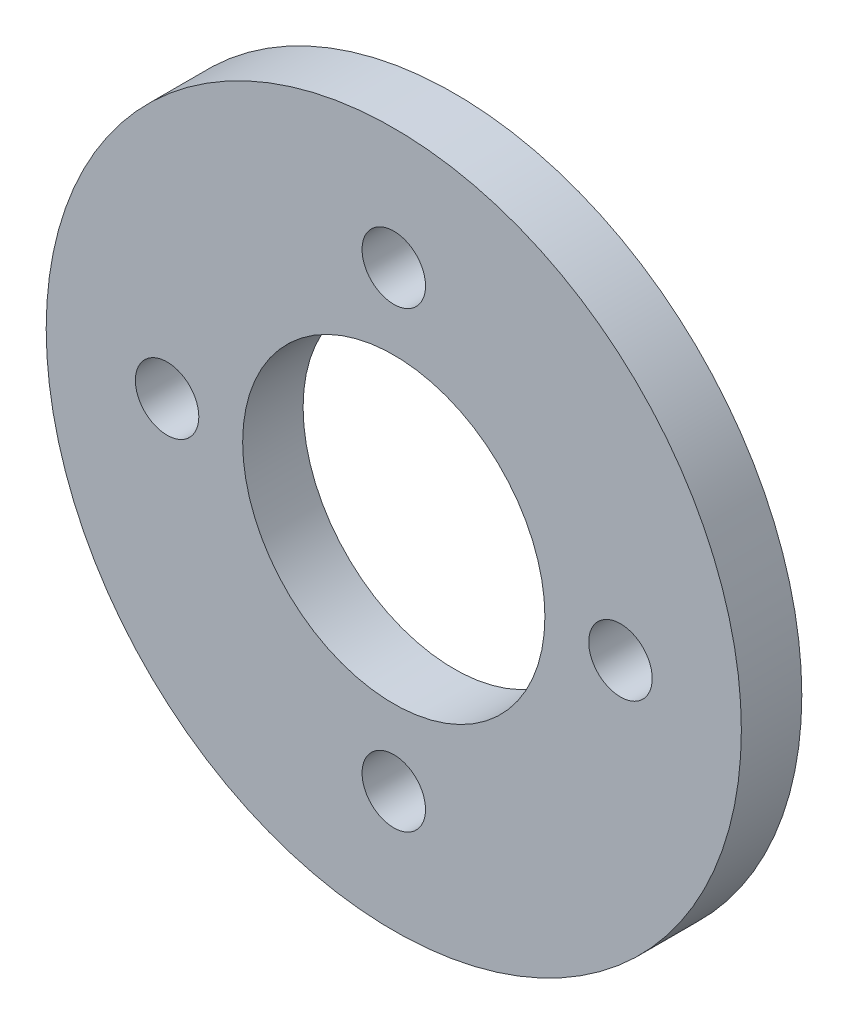
ISO-10303-21;
HEADER;
FILE_DESCRIPTION(('STEP AP214'),'2;1');
FILE_NAME('part.step','',(''),(''),'','','');
FILE_SCHEMA(('AUTOMOTIVE_DESIGN { 1 0 10303 214 1 1 1 1 }'));
ENDSEC;
DATA;
#1=APPLICATION_CONTEXT('core data for automotive mechanical design processes');
#2=APPLICATION_PROTOCOL_DEFINITION('international standard','automotive_design',2000,#1);
#3=PRODUCT_CONTEXT('',#1,'mechanical');
#4=PRODUCT('Part','Part','',(#3));
#5=PRODUCT_RELATED_PRODUCT_CATEGORY('part','',(#4));
#6=PRODUCT_DEFINITION_FORMATION('','',#4);
#7=PRODUCT_DEFINITION_CONTEXT('part definition',#1,'design');
#8=PRODUCT_DEFINITION('design','',#6,#7);
#9=PRODUCT_DEFINITION_SHAPE('','',#8);
#10=(LENGTH_UNIT() NAMED_UNIT(*) SI_UNIT(.MILLI.,.METRE.));
#11=(NAMED_UNIT(*) PLANE_ANGLE_UNIT() SI_UNIT($,.RADIAN.));
#12=(NAMED_UNIT(*) SI_UNIT($,.STERADIAN.) SOLID_ANGLE_UNIT());
#13=UNCERTAINTY_MEASURE_WITH_UNIT(LENGTH_MEASURE(1.E-05),#10,'distance_accuracy_value','');
#14=(GEOMETRIC_REPRESENTATION_CONTEXT(3) GLOBAL_UNCERTAINTY_ASSIGNED_CONTEXT((#13)) GLOBAL_UNIT_ASSIGNED_CONTEXT((#10,
#11,#12)) REPRESENTATION_CONTEXT('',''));
#15=CARTESIAN_POINT('',(0.,0.,0.));
#16=DIRECTION('',(0.,0.,1.));
#17=DIRECTION('',(1.,0.,0.));
#18=AXIS2_PLACEMENT_3D('',#15,#16,#17);
#19=CARTESIAN_POINT('',(0.,0.,4.));
#20=DIRECTION('',(0.,0.,1.));
#21=DIRECTION('',(1.,0.,0.));
#22=AXIS2_PLACEMENT_3D('',#19,#20,#21);
#23=PLANE('',#22);
#24=CARTESIAN_POINT('',(0.,-15.,4.));
#25=DIRECTION('',(0.,0.,1.));
#26=DIRECTION('',(1.,0.,0.));
#27=AXIS2_PLACEMENT_3D('',#24,#25,#26);
#28=CIRCLE('',#27,2.1);
#29=CARTESIAN_POINT('',(2.1,-15.,4.));
#30=VERTEX_POINT('',#29);
#31=EDGE_CURVE('E63',#30,#30,#28,.T.);
#32=ORIENTED_EDGE('',*,*,#31,.F.);
#33=EDGE_LOOP('',(#32));
#34=FACE_BOUND('',#33,.T.);
#35=CARTESIAN_POINT('',(0.,0.,4.));
#36=DIRECTION('',(0.,0.,1.));
#37=DIRECTION('',(1.,0.,0.));
#38=AXIS2_PLACEMENT_3D('',#35,#36,#37);
#39=CIRCLE('',#38,10.);
#40=CARTESIAN_POINT('',(10.,0.,4.));
#41=VERTEX_POINT('',#40);
#42=EDGE_CURVE('E51',#41,#41,#39,.T.);
#43=ORIENTED_EDGE('',*,*,#42,.F.);
#44=EDGE_LOOP('',(#43));
#45=FACE_BOUND('',#44,.T.);
#46=CARTESIAN_POINT('',(0.,0.,4.));
#47=DIRECTION('',(0.,0.,1.));
#48=DIRECTION('',(1.,0.,0.));
#49=AXIS2_PLACEMENT_3D('',#46,#47,#48);
#50=CIRCLE('',#49,23.);
#51=CARTESIAN_POINT('',(23.,0.,4.));
#52=VERTEX_POINT('',#51);
#53=EDGE_CURVE('E10',#52,#52,#50,.T.);
#54=ORIENTED_EDGE('',*,*,#53,.T.);
#55=EDGE_LOOP('',(#54));
#56=FACE_BOUND('',#55,.T.);
#57=CARTESIAN_POINT('',(0.,15.,4.));
#58=DIRECTION('',(0.,0.,1.));
#59=DIRECTION('',(1.,0.,0.));
#60=AXIS2_PLACEMENT_3D('',#57,#58,#59);
#61=CIRCLE('',#60,2.1);
#62=CARTESIAN_POINT('',(2.1,15.,4.));
#63=VERTEX_POINT('',#62);
#64=EDGE_CURVE('E46',#63,#63,#61,.T.);
#65=ORIENTED_EDGE('',*,*,#64,.F.);
#66=EDGE_LOOP('',(#65));
#67=FACE_BOUND('',#66,.T.);
#68=CARTESIAN_POINT('',(15.,0.,4.));
#69=DIRECTION('',(0.,0.,1.));
#70=DIRECTION('',(1.,0.,0.));
#71=AXIS2_PLACEMENT_3D('',#68,#69,#70);
#72=CIRCLE('',#71,2.1);
#73=CARTESIAN_POINT('',(17.1,0.,4.));
#74=VERTEX_POINT('',#73);
#75=EDGE_CURVE('E57',#74,#74,#72,.T.);
#76=ORIENTED_EDGE('',*,*,#75,.F.);
#77=EDGE_LOOP('',(#76));
#78=FACE_BOUND('',#77,.T.);
#79=CARTESIAN_POINT('',(-15.,0.,4.));
#80=DIRECTION('',(0.,0.,1.));
#81=DIRECTION('',(1.,0.,0.));
#82=AXIS2_PLACEMENT_3D('',#79,#80,#81);
#83=CIRCLE('',#82,2.1);
#84=CARTESIAN_POINT('',(-12.9,0.,4.));
#85=VERTEX_POINT('',#84);
#86=EDGE_CURVE('E69',#85,#85,#83,.T.);
#87=ORIENTED_EDGE('',*,*,#86,.F.);
#88=EDGE_LOOP('',(#87));
#89=FACE_BOUND('',#88,.T.);
#90=ADVANCED_FACE('F35',(#34,#45,#56,#67,#78,#89),#23,.T.);
#91=CARTESIAN_POINT('',(0.,0.,0.));
#92=DIRECTION('',(0.,0.,1.));
#93=DIRECTION('',(1.,0.,0.));
#94=AXIS2_PLACEMENT_3D('',#91,#92,#93);
#95=PLANE('',#94);
#96=CARTESIAN_POINT('',(0.,0.,0.));
#97=DIRECTION('',(0.,0.,1.));
#98=DIRECTION('',(1.,0.,0.));
#99=AXIS2_PLACEMENT_3D('',#96,#97,#98);
#100=CIRCLE('',#99,23.);
#101=CARTESIAN_POINT('',(23.,0.,0.));
#102=VERTEX_POINT('',#101);
#103=EDGE_CURVE('E39',#102,#102,#100,.T.);
#104=ORIENTED_EDGE('',*,*,#103,.F.);
#105=EDGE_LOOP('',(#104));
#106=FACE_BOUND('',#105,.T.);
#107=CARTESIAN_POINT('',(0.,15.,0.));
#108=DIRECTION('',(0.,0.,1.));
#109=DIRECTION('',(1.,0.,0.));
#110=AXIS2_PLACEMENT_3D('',#107,#108,#109);
#111=CIRCLE('',#110,2.1);
#112=CARTESIAN_POINT('',(2.1,15.,0.));
#113=VERTEX_POINT('',#112);
#114=EDGE_CURVE('E48',#113,#113,#111,.T.);
#115=ORIENTED_EDGE('',*,*,#114,.T.);
#116=EDGE_LOOP('',(#115));
#117=FACE_BOUND('',#116,.T.);
#118=CARTESIAN_POINT('',(0.,0.,0.));
#119=DIRECTION('',(0.,0.,1.));
#120=DIRECTION('',(1.,0.,0.));
#121=AXIS2_PLACEMENT_3D('',#118,#119,#120);
#122=CIRCLE('',#121,10.);
#123=CARTESIAN_POINT('',(10.,0.,0.));
#124=VERTEX_POINT('',#123);
#125=EDGE_CURVE('E54',#124,#124,#122,.T.);
#126=ORIENTED_EDGE('',*,*,#125,.T.);
#127=EDGE_LOOP('',(#126));
#128=FACE_BOUND('',#127,.T.);
#129=CARTESIAN_POINT('',(15.,0.,0.));
#130=DIRECTION('',(0.,0.,1.));
#131=DIRECTION('',(1.,0.,0.));
#132=AXIS2_PLACEMENT_3D('',#129,#130,#131);
#133=CIRCLE('',#132,2.1);
#134=CARTESIAN_POINT('',(17.1,0.,0.));
#135=VERTEX_POINT('',#134);
#136=EDGE_CURVE('E60',#135,#135,#133,.T.);
#137=ORIENTED_EDGE('',*,*,#136,.T.);
#138=EDGE_LOOP('',(#137));
#139=FACE_BOUND('',#138,.T.);
#140=CARTESIAN_POINT('',(0.,-15.,0.));
#141=DIRECTION('',(0.,0.,1.));
#142=DIRECTION('',(1.,0.,0.));
#143=AXIS2_PLACEMENT_3D('',#140,#141,#142);
#144=CIRCLE('',#143,2.1);
#145=CARTESIAN_POINT('',(2.1,-15.,0.));
#146=VERTEX_POINT('',#145);
#147=EDGE_CURVE('E66',#146,#146,#144,.T.);
#148=ORIENTED_EDGE('',*,*,#147,.T.);
#149=EDGE_LOOP('',(#148));
#150=FACE_BOUND('',#149,.T.);
#151=CARTESIAN_POINT('',(-15.,0.,0.));
#152=DIRECTION('',(0.,0.,1.));
#153=DIRECTION('',(1.,0.,0.));
#154=AXIS2_PLACEMENT_3D('',#151,#152,#153);
#155=CIRCLE('',#154,2.1);
#156=CARTESIAN_POINT('',(-12.9,0.,0.));
#157=VERTEX_POINT('',#156);
#158=EDGE_CURVE('E72',#157,#157,#155,.T.);
#159=ORIENTED_EDGE('',*,*,#158,.T.);
#160=EDGE_LOOP('',(#159));
#161=FACE_BOUND('',#160,.T.);
#162=ADVANCED_FACE('F82',(#106,#117,#128,#139,#150,#161),#95,.F.);
#163=CARTESIAN_POINT('',(0.,0.,4.));
#164=DIRECTION('',(0.,0.,-1.));
#165=DIRECTION('',(-1.,0.,0.));
#166=AXIS2_PLACEMENT_3D('',#163,#164,#165);
#167=CYLINDRICAL_SURFACE('',#166,23.);
#168=ORIENTED_EDGE('',*,*,#53,.F.);
#169=EDGE_LOOP('',(#168));
#170=FACE_BOUND('',#169,.T.);
#171=ORIENTED_EDGE('',*,*,#103,.T.);
#172=EDGE_LOOP('',(#171));
#173=FACE_BOUND('',#172,.T.);
#174=ADVANCED_FACE('F37',(#170,#173),#167,.T.);
#175=CARTESIAN_POINT('',(0.,15.,4.));
#176=DIRECTION('',(0.,0.,-1.));
#177=DIRECTION('',(-1.,0.,0.));
#178=AXIS2_PLACEMENT_3D('',#175,#176,#177);
#179=CYLINDRICAL_SURFACE('',#178,2.1);
#180=ORIENTED_EDGE('',*,*,#64,.T.);
#181=EDGE_LOOP('',(#180));
#182=FACE_BOUND('',#181,.T.);
#183=ORIENTED_EDGE('',*,*,#114,.F.);
#184=EDGE_LOOP('',(#183));
#185=FACE_BOUND('',#184,.T.);
#186=ADVANCED_FACE('F92',(#182,#185),#179,.F.);
#187=CARTESIAN_POINT('',(0.,0.,4.));
#188=DIRECTION('',(0.,0.,-1.));
#189=DIRECTION('',(-1.,0.,0.));
#190=AXIS2_PLACEMENT_3D('',#187,#188,#189);
#191=CYLINDRICAL_SURFACE('',#190,10.);
#192=ORIENTED_EDGE('',*,*,#42,.T.);
#193=EDGE_LOOP('',(#192));
#194=FACE_BOUND('',#193,.T.);
#195=ORIENTED_EDGE('',*,*,#125,.F.);
#196=EDGE_LOOP('',(#195));
#197=FACE_BOUND('',#196,.T.);
#198=ADVANCED_FACE('F95',(#194,#197),#191,.F.);
#199=CARTESIAN_POINT('',(15.,0.,4.));
#200=DIRECTION('',(0.,0.,-1.));
#201=DIRECTION('',(-1.,0.,0.));
#202=AXIS2_PLACEMENT_3D('',#199,#200,#201);
#203=CYLINDRICAL_SURFACE('',#202,2.1);
#204=ORIENTED_EDGE('',*,*,#75,.T.);
#205=EDGE_LOOP('',(#204));
#206=FACE_BOUND('',#205,.T.);
#207=ORIENTED_EDGE('',*,*,#136,.F.);
#208=EDGE_LOOP('',(#207));
#209=FACE_BOUND('',#208,.T.);
#210=ADVANCED_FACE('F99',(#206,#209),#203,.F.);
#211=CARTESIAN_POINT('',(0.,-15.,4.));
#212=DIRECTION('',(0.,0.,-1.));
#213=DIRECTION('',(-1.,0.,0.));
#214=AXIS2_PLACEMENT_3D('',#211,#212,#213);
#215=CYLINDRICAL_SURFACE('',#214,2.1);
#216=ORIENTED_EDGE('',*,*,#31,.T.);
#217=EDGE_LOOP('',(#216));
#218=FACE_BOUND('',#217,.T.);
#219=ORIENTED_EDGE('',*,*,#147,.F.);
#220=EDGE_LOOP('',(#219));
#221=FACE_BOUND('',#220,.T.);
#222=ADVANCED_FACE('F103',(#218,#221),#215,.F.);
#223=CARTESIAN_POINT('',(-15.,0.,4.));
#224=DIRECTION('',(0.,0.,-1.));
#225=DIRECTION('',(-1.,0.,0.));
#226=AXIS2_PLACEMENT_3D('',#223,#224,#225);
#227=CYLINDRICAL_SURFACE('',#226,2.1);
#228=ORIENTED_EDGE('',*,*,#86,.T.);
#229=EDGE_LOOP('',(#228));
#230=FACE_BOUND('',#229,.T.);
#231=ORIENTED_EDGE('',*,*,#158,.F.);
#232=EDGE_LOOP('',(#231));
#233=FACE_BOUND('',#232,.T.);
#234=ADVANCED_FACE('F78',(#230,#233),#227,.F.);
#235=CLOSED_SHELL('',(#90,#162,#174,#186,#198,#210,#222,#234));
#236=MANIFOLD_SOLID_BREP('B2',#235);
#237=ADVANCED_BREP_SHAPE_REPRESENTATION('',(#18,#236),#14);
#238=SHAPE_DEFINITION_REPRESENTATION(#9,#237);
ENDSEC;
END-ISO-10303-21;
